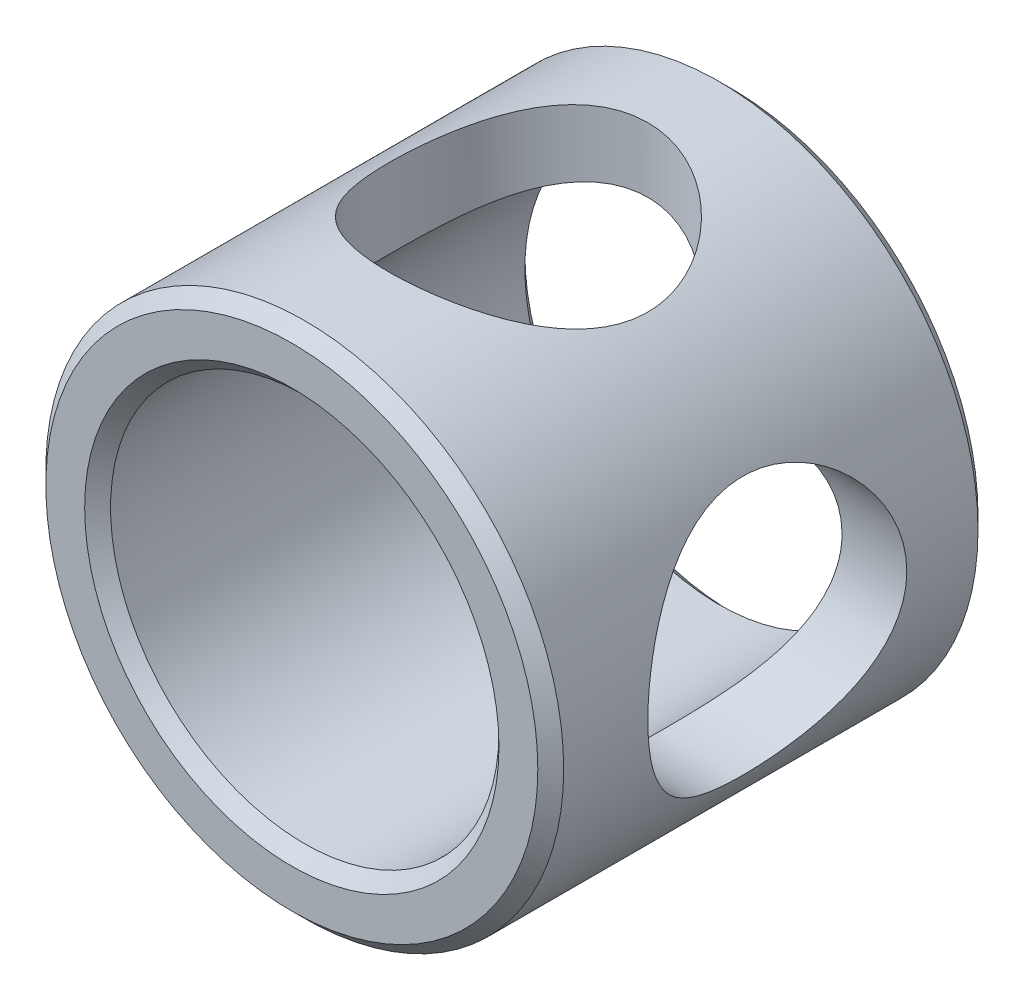
ISO-10303-21;
HEADER;
FILE_DESCRIPTION(('STEP AP214'),'2;1');
FILE_NAME('part.step','',(''),(''),'','','');
FILE_SCHEMA(('AUTOMOTIVE_DESIGN { 1 0 10303 214 1 1 1 1 }'));
ENDSEC;
DATA;
#1=APPLICATION_CONTEXT('core data for automotive mechanical design processes');
#2=APPLICATION_PROTOCOL_DEFINITION('international standard','automotive_design',2000,#1);
#3=PRODUCT_CONTEXT('',#1,'mechanical');
#4=PRODUCT('Part','Part','',(#3));
#5=PRODUCT_RELATED_PRODUCT_CATEGORY('part','',(#4));
#6=PRODUCT_DEFINITION_FORMATION('','',#4);
#7=PRODUCT_DEFINITION_CONTEXT('part definition',#1,'design');
#8=PRODUCT_DEFINITION('design','',#6,#7);
#9=PRODUCT_DEFINITION_SHAPE('','',#8);
#10=(LENGTH_UNIT() NAMED_UNIT(*) SI_UNIT(.MILLI.,.METRE.));
#11=(NAMED_UNIT(*) PLANE_ANGLE_UNIT() SI_UNIT($,.RADIAN.));
#12=(NAMED_UNIT(*) SI_UNIT($,.STERADIAN.) SOLID_ANGLE_UNIT());
#13=UNCERTAINTY_MEASURE_WITH_UNIT(LENGTH_MEASURE(1.E-05),#10,'distance_accuracy_value','');
#14=(GEOMETRIC_REPRESENTATION_CONTEXT(3) GLOBAL_UNCERTAINTY_ASSIGNED_CONTEXT((#13)) GLOBAL_UNIT_ASSIGNED_CONTEXT((#10,
#11,#12)) REPRESENTATION_CONTEXT('',''));
#15=CARTESIAN_POINT('',(0.,0.,0.));
#16=DIRECTION('',(0.,0.,1.));
#17=DIRECTION('',(1.,0.,0.));
#18=AXIS2_PLACEMENT_3D('',#15,#16,#17);
#19=CARTESIAN_POINT('',(0.,0.,6.8));
#20=DIRECTION('',(0.,0.,1.));
#21=DIRECTION('',(1.,0.,0.));
#22=AXIS2_PLACEMENT_3D('',#19,#20,#21);
#23=PLANE('',#22);
#24=CARTESIAN_POINT('',(0.,0.,6.8));
#25=DIRECTION('',(0.,0.,1.));
#26=DIRECTION('',(1.,0.,0.));
#27=AXIS2_PLACEMENT_3D('',#24,#25,#26);
#28=CIRCLE('',#27,3.8);
#29=CARTESIAN_POINT('',(3.8,0.,6.8));
#30=VERTEX_POINT('',#29);
#31=EDGE_CURVE('E10',#30,#30,#28,.T.);
#32=ORIENTED_EDGE('',*,*,#31,.T.);
#33=EDGE_LOOP('',(#32));
#34=FACE_BOUND('',#33,.T.);
#35=CARTESIAN_POINT('',(0.,0.,6.8));
#36=DIRECTION('',(0.,0.,1.));
#37=DIRECTION('',(1.,0.,0.));
#38=AXIS2_PLACEMENT_3D('',#35,#36,#37);
#39=CIRCLE('',#38,3.20000000000001);
#40=CARTESIAN_POINT('',(3.20000000000001,0.,6.8));
#41=VERTEX_POINT('',#40);
#42=EDGE_CURVE('E38',#41,#41,#39,.F.);
#43=ORIENTED_EDGE('',*,*,#42,.T.);
#44=EDGE_LOOP('',(#43));
#45=FACE_BOUND('',#44,.T.);
#46=ADVANCED_FACE('F31',(#34,#45),#23,.T.);
#47=CARTESIAN_POINT('',(0.,0.,0.));
#48=DIRECTION('',(0.,0.,1.));
#49=DIRECTION('',(1.,0.,0.));
#50=AXIS2_PLACEMENT_3D('',#47,#48,#49);
#51=PLANE('',#50);
#52=CARTESIAN_POINT('',(0.,0.,0.));
#53=DIRECTION('',(0.,0.,1.));
#54=DIRECTION('',(1.,0.,0.));
#55=AXIS2_PLACEMENT_3D('',#52,#53,#54);
#56=CIRCLE('',#55,3.2);
#57=CARTESIAN_POINT('',(3.2,0.,0.));
#58=VERTEX_POINT('',#57);
#59=EDGE_CURVE('E57',#58,#58,#56,.T.);
#60=ORIENTED_EDGE('',*,*,#59,.T.);
#61=EDGE_LOOP('',(#60));
#62=FACE_BOUND('',#61,.T.);
#63=CARTESIAN_POINT('',(0.,0.,0.));
#64=DIRECTION('',(0.,0.,1.));
#65=DIRECTION('',(1.,0.,0.));
#66=AXIS2_PLACEMENT_3D('',#63,#64,#65);
#67=CIRCLE('',#66,3.8);
#68=CARTESIAN_POINT('',(3.8,0.,0.));
#69=VERTEX_POINT('',#68);
#70=EDGE_CURVE('E60',#69,#69,#67,.F.);
#71=ORIENTED_EDGE('',*,*,#70,.T.);
#72=EDGE_LOOP('',(#71));
#73=FACE_BOUND('',#72,.T.);
#74=ADVANCED_FACE('F109',(#62,#73),#51,.F.);
#75=CARTESIAN_POINT('',(0.,0.,6.8));
#76=DIRECTION('',(0.,0.,-1.));
#77=DIRECTION('',(-1.,0.,0.));
#78=AXIS2_PLACEMENT_3D('',#75,#76,#77);
#79=CYLINDRICAL_SURFACE('',#78,4.);
#80=CARTESIAN_POINT('',(-2.00000000000001,3.46410161513775,3.3));
#81=CARTESIAN_POINT('',(-1.99999158748782,3.46411185715887,3.40421320547434));
#82=CARTESIAN_POINT('',(-1.99179963610438,3.46887633544977,3.5085621765338));
#83=CARTESIAN_POINT('',(-1.95944672580054,3.48724701669072,3.7140551772306));
#84=CARTESIAN_POINT('',(-1.93525221095663,3.50087179788182,3.81519200324776));
#85=CARTESIAN_POINT('',(-1.87219981598031,3.53498701490001,4.01090315644694));
#86=CARTESIAN_POINT('',(-1.83341988295965,3.55544089069168,4.10550925884925));
#87=CARTESIAN_POINT('',(-1.7425350724514,3.60085327291132,4.28684845047615));
#88=CARTESIAN_POINT('',(-1.6904294741014,3.62581202301253,4.37358111343677));
#89=CARTESIAN_POINT('',(-1.56933307453802,3.67993738819288,4.54461144313338));
#90=CARTESIAN_POINT('',(-1.49930407053534,3.70928127465102,4.62811826759177));
#91=CARTESIAN_POINT('',(-1.34650761698203,3.76743965382121,4.7828167805706));
#92=CARTESIAN_POINT('',(-1.26373385204843,3.79625387610258,4.85400232620397));
#93=CARTESIAN_POINT('',(-1.08097912631266,3.85242953961661,4.9867343011885));
#94=CARTESIAN_POINT('',(-0.980214377887166,3.87956212851245,5.04730753542331));
#95=CARTESIAN_POINT('',(-0.768314053336931,3.92701512184167,5.15028170678709));
#96=CARTESIAN_POINT('',(-0.657185076311999,3.94733982363631,5.1926941123508));
#97=CARTESIAN_POINT('',(-0.436089887818831,3.97760922492053,5.25500932253118));
#98=CARTESIAN_POINT('',(-0.326603580968799,3.98818960442739,5.2762990526921));
#99=CARTESIAN_POINT('',(-0.105141257404554,4.00015167691179,5.30033223736903));
#100=CARTESIAN_POINT('',(0.0068332116851934,4.00153893568935,5.30308691359629));
#101=CARTESIAN_POINT('',(0.219665048849558,3.99525963833124,5.29050665205486));
#102=CARTESIAN_POINT('',(0.320642398354125,3.98836991784381,5.27672396895636));
#103=CARTESIAN_POINT('',(0.518627543836075,3.96748490519435,5.23423831219188));
#104=CARTESIAN_POINT('',(0.615635042187687,3.95348908132772,5.20553422204788));
#105=CARTESIAN_POINT('',(0.804618783139246,3.91943166575326,5.13383486782005));
#106=CARTESIAN_POINT('',(0.896506847030384,3.89928883058403,5.09064737365578));
#107=CARTESIAN_POINT('',(1.0719536030266,3.8547529197337,4.9914731675971));
#108=CARTESIAN_POINT('',(1.15550929767727,3.83035832314967,4.93548187339533));
#109=CARTESIAN_POINT('',(1.32034732179639,3.7768878879846,4.80620929693394));
#110=CARTESIAN_POINT('',(1.40066815005871,3.74758751996351,4.73179394334797));
#111=CARTESIAN_POINT('',(1.54820874059554,3.68908681173623,4.57082055013965));
#112=CARTESIAN_POINT('',(1.61541842314845,3.65988656531258,4.48425325545188));
#113=CARTESIAN_POINT('',(1.73901066928441,3.6028831218497,4.29470361515182));
#114=CARTESIAN_POINT('',(1.79443462995609,3.57528639981416,4.19102795389158));
#115=CARTESIAN_POINT('',(1.88663822600245,3.52750900557152,3.974124657282));
#116=CARTESIAN_POINT('',(1.92343731642177,3.50732060092135,3.86090713396488));
#117=CARTESIAN_POINT('',(1.97436042205007,3.47889271634069,3.63757097743442));
#118=CARTESIAN_POINT('',(1.99005024423994,3.46983311696993,3.5279177619129));
#119=CARTESIAN_POINT('',(2.00303389322284,3.4623583872322,3.30719731696691));
#120=CARTESIAN_POINT('',(2.00034071463004,3.46393573778624,3.1961311417604));
#121=CARTESIAN_POINT('',(1.97807208668792,3.4766867308117,2.98869216284256));
#122=CARTESIAN_POINT('',(1.96037563342491,3.48679175013309,2.89204109778422));
#123=CARTESIAN_POINT('',(1.91139256926488,3.51388043102683,2.70326442745801));
#124=CARTESIAN_POINT('',(1.88010155724725,3.53086632010069,2.61114029850652));
#125=CARTESIAN_POINT('',(1.80329517720972,3.57072444159314,2.42917733819489));
#126=CARTESIAN_POINT('',(1.75718812738529,3.59383286486126,2.33964196629395));
#127=CARTESIAN_POINT('',(1.65257412803174,3.64312238994501,2.16906145692096));
#128=CARTESIAN_POINT('',(1.59406080866497,3.66930506710298,2.08802071296949));
#129=CARTESIAN_POINT('',(1.45767433439707,3.72575996912669,1.92604246495734));
#130=CARTESIAN_POINT('',(1.37829054462746,3.75613166308566,1.84640569858222));
#131=CARTESIAN_POINT('',(1.20680899079902,3.81468469955797,1.70117552399527));
#132=CARTESIAN_POINT('',(1.11470694931989,3.84286530015464,1.63558685947316));
#133=CARTESIAN_POINT('',(0.917070725108045,3.89482723381868,1.51885254816729));
#134=CARTESIAN_POINT('',(0.811246195112481,3.91847283343884,1.46813376383323));
#135=CARTESIAN_POINT('',(0.591044729317852,3.95766709918776,1.38572419203039));
#136=CARTESIAN_POINT('',(0.476675402917639,3.97322287353397,1.3540166963159));
#137=CARTESIAN_POINT('',(0.25395936453975,3.99335016363174,1.31326287251486));
#138=CARTESIAN_POINT('',(0.146022887268286,3.9987985581427,1.30240425133572));
#139=CARTESIAN_POINT('',(-0.0702519714699596,4.00084260752374,1.29831346600433));
#140=CARTESIAN_POINT('',(-0.178590198981628,3.99744136141634,1.30507513147113));
#141=CARTESIAN_POINT('',(-0.385075986136872,3.98267937668509,1.3348328243164));
#142=CARTESIAN_POINT('',(-0.483424641057431,3.97185789309443,1.35672973730905));
#143=CARTESIAN_POINT('',(-0.674891898931578,3.94384187353387,1.41465395980667));
#144=CARTESIAN_POINT('',(-0.768009749669785,3.92664642364424,1.45068329570691));
#145=CARTESIAN_POINT('',(-0.950846833596754,3.8865186139318,1.5374542549914));
#146=CARTESIAN_POINT('',(-1.04025036572291,3.86337234005403,1.58875921975186));
#147=CARTESIAN_POINT('',(-1.20954920326829,3.81376266676027,1.70391528811809));
#148=CARTESIAN_POINT('',(-1.2894401144432,3.78729774583427,1.76777215410157));
#149=CARTESIAN_POINT('',(-1.44582833859496,3.73057218840581,1.91359663555941));
#150=CARTESIAN_POINT('',(-1.521196658792,3.70019591726075,1.99673418080029));
#151=CARTESIAN_POINT('',(-1.65732528394007,3.64126158628571,2.17489222830609));
#152=CARTESIAN_POINT('',(-1.71807266521245,3.61270515130783,2.26992313136052));
#153=CARTESIAN_POINT('',(-1.82486714716812,3.55999186256751,2.47330889413024));
#154=CARTESIAN_POINT('',(-1.87038902381915,3.53600256268535,2.58198991073527));
#155=CARTESIAN_POINT('',(-1.92395929504802,3.50696218132369,2.75057811963094));
#156=CARTESIAN_POINT('',(-1.93935666147968,3.498443893294,2.80764782059068));
#157=CARTESIAN_POINT('',(-1.96508069805044,3.48406059323535,2.92323255750019));
#158=CARTESIAN_POINT('',(-1.97541091343284,3.4781937263605,2.98174655275425));
#159=CARTESIAN_POINT('',(-1.98872932961221,3.47059023668757,3.08360078924729));
#160=CARTESIAN_POINT('',(-1.99295091983788,3.46816389731815,3.12673305725007));
#161=CARTESIAN_POINT('',(-1.99858810035607,3.46491740045176,3.2132356930929));
#162=CARTESIAN_POINT('',(-2.00000350293332,3.46409735040491,3.2566060766667));
#163=CARTESIAN_POINT('',(-2.00000000000001,3.46410161513775,3.3));
#164=B_SPLINE_CURVE_WITH_KNOTS('',3,(#80,#81,#82,#83,#84,#85,#86,#87,#88,#89,#90,#91,#92,#93,
#94,#95,#96,#97,#98,#99,#100,#101,#102,#103,#104,#105,#106,#107,#108,#109,#110,#111,#112,#113,
#114,#115,#116,#117,#118,#119,#120,#121,#122,#123,#124,#125,#126,#127,#128,#129,#130,#131,#132,
#133,#134,#135,#136,#137,#138,#139,#140,#141,#142,#143,#144,#145,#146,#147,#148,#149,#150,#151,
#152,#153,#154,#155,#156,#157,#158,#159,#160,#161,#162,#163),.UNSPECIFIED.,.T.,.F.,(4,2,2,2,2,2,
2,2,2,2,2,2,2,2,2,2,2,2,2,2,2,2,2,2,2,2,2,2,2,2,2,2,2,2,2,2,2,2,2,2,2,4),(0.,0.312464245189431,
0.62558578564961,0.937057191861537,1.24854545093096,1.58572462503713,1.92307142172809,
2.28315784481594,2.64301653931849,2.97726969939937,3.31132047376147,3.61632194973143,
3.92134625038977,4.2305906946636,4.5399459870461,4.87854382917848,5.21740096495904,
5.57777683462963,5.93777548427476,6.2692458171249,6.60048186380813,6.89548366852118,
7.19058104876193,7.49934592816242,7.80826972444161,8.15613487165293,8.50411729960471,
8.86128362829998,9.2181355962161,9.5422454078304,9.8662417359201,10.1688884974705,
10.4715786702809,10.7872150144301,11.1029966020551,11.450204837042,11.7977188569438,
12.1562149808128,12.3351395323571,12.5139387197526,12.6440387634036,12.7741475095882),.UNSPECIFIED.);
#165=CARTESIAN_POINT('',(-2.00000000000001,3.46410161513775,3.3));
#166=VERTEX_POINT('',#165);
#167=EDGE_CURVE('E90',#166,#166,#164,.T.);
#168=ORIENTED_EDGE('',*,*,#167,.F.);
#169=EDGE_LOOP('',(#168));
#170=FACE_BOUND('',#169,.T.);
#171=CARTESIAN_POINT('',(4.,0.,1.3));
#172=CARTESIAN_POINT('',(3.99999426810082,0.105143925902467,1.30000660463438));
#173=CARTESIAN_POINT('',(3.99580982039513,0.210413199395125,1.30834014624211));
#174=CARTESIAN_POINT('',(3.97948312074314,0.417840470537792,1.34130576068308));
#175=CARTESIAN_POINT('',(3.96732575657839,0.519992173427259,1.36596878599563));
#176=CARTESIAN_POINT('',(3.93632558806751,0.717867089760898,1.43038761723326));
#177=CARTESIAN_POINT('',(3.91750878355075,0.813613605878293,1.47008476849594));
#178=CARTESIAN_POINT('',(3.87491553031523,0.996945233613197,1.56314124272997));
#179=CARTESIAN_POINT('',(3.85113947267051,1.08453098798012,1.61649948849773));
#180=CARTESIAN_POINT('',(3.79912516516124,1.25501563552382,1.73903449897057));
#181=CARTESIAN_POINT('',(3.77070398255074,1.33731042224422,1.80897295847928));
#182=CARTESIAN_POINT('',(3.71319940493486,1.48955888973396,1.96104295849407));
#183=CARTESIAN_POINT('',(3.68411552418069,1.55950316621353,2.04318370354488));
#184=CARTESIAN_POINT('',(3.62597902394695,1.69050400090056,2.22496669904676));
#185=CARTESIAN_POINT('',(3.59710373940264,1.75045067110327,2.32547219669183));
#186=CARTESIAN_POINT('',(3.54571957544641,1.85233645378139,2.53673467197243));
#187=CARTESIAN_POINT('',(3.52320615213979,1.89428842993267,2.6474842574455));
#188=CARTESIAN_POINT('',(3.48915734075617,1.95626488437718,2.86933021084384));
#189=CARTESIAN_POINT('',(3.47704543167427,1.97745171416088,2.98000890413479));
#190=CARTESIAN_POINT('',(3.46363779897055,2.00085398661769,3.20395767555895));
#191=CARTESIAN_POINT('',(3.46233138686576,2.00308817674615,3.31722508174231));
#192=CARTESIAN_POINT('',(3.47021860514497,1.98937457434459,3.52857204863074));
#193=CARTESIAN_POINT('',(3.47817527324027,1.97556911907364,3.6268480624461));
#194=CARTESIAN_POINT('',(3.50152457467701,1.93387969811386,3.81944381874608));
#195=CARTESIAN_POINT('',(3.51691957663553,1.9059912477953,3.91376229061063));
#196=CARTESIAN_POINT('',(3.55374952825482,1.83641956077201,4.09845826513132));
#197=CARTESIAN_POINT('',(3.57531681327997,1.79443013423199,4.18869279757158));
#198=CARTESIAN_POINT('',(3.62206808562807,1.698083375336,4.36126858518002));
#199=CARTESIAN_POINT('',(3.64725369560381,1.64372048762493,4.44360627120018));
#200=CARTESIAN_POINT('',(3.70226315806572,1.51613210982558,4.60904250548645));
#201=CARTESIAN_POINT('',(3.73227020473492,1.44138891673856,4.69091374715231));
#202=CARTESIAN_POINT('',(3.79095246600814,1.27911115748275,4.8414708371818));
#203=CARTESIAN_POINT('',(3.81962703917602,1.19157051314857,4.91015038406777));
#204=CARTESIAN_POINT('',(3.87403974565928,1.0010330116637,5.03537132205945));
#205=CARTESIAN_POINT('',(3.89957968324014,0.897507183198818,5.09120094489148));
#206=CARTESIAN_POINT('',(3.94315762242485,0.680932430977593,5.18419405808602));
#207=CARTESIAN_POINT('',(3.96120157887106,0.567891152530552,5.22137237003033));
#208=CARTESIAN_POINT('',(3.98648667482871,0.345532983321405,5.27295080743335));
#209=CARTESIAN_POINT('',(3.9944987660262,0.236683061096653,5.28898247149356));
#210=CARTESIAN_POINT('',(4.00146026918207,0.0175591998987038,5.30292946226898));
#211=CARTESIAN_POINT('',(4.00041397442637,-0.0927140397398167,5.30085337127894));
#212=CARTESIAN_POINT('',(3.9898238450687,-0.302465943971973,5.27958662316251));
#213=CARTESIAN_POINT('',(3.98094491376337,-0.402118816099859,5.26173493454001));
#214=CARTESIAN_POINT('',(3.95644342629681,-0.596813784603881,5.21152385620976));
#215=CARTESIAN_POINT('',(3.94082012668824,-0.691855371382173,5.17916286709301));
#216=CARTESIAN_POINT('',(3.90368502827176,-0.877777216899145,5.10000306713393));
#217=CARTESIAN_POINT('',(3.88201763539262,-0.968460794011606,5.05281789976743));
#218=CARTESIAN_POINT('',(3.83487948634835,-1.14092272339854,4.94578492870687));
#219=CARTESIAN_POINT('',(3.80940711133877,-1.22269725955318,4.88593173080921));
#220=CARTESIAN_POINT('',(3.75416442672396,-1.38353537857843,4.74847914933857));
#221=CARTESIAN_POINT('',(3.72421769686998,-1.46154415563805,4.66971426310971));
#222=CARTESIAN_POINT('',(3.6652478321764,-1.60371264223771,4.50014969744455));
#223=CARTESIAN_POINT('',(3.63622534800094,-1.66786277142375,4.40934176230416));
#224=CARTESIAN_POINT('',(3.58102384412979,-1.78341582895804,4.21271269165405));
#225=CARTESIAN_POINT('',(3.55505059178121,-1.8340509916005,4.10637746781104));
#226=CARTESIAN_POINT('',(3.51148144588269,-1.91616565186941,3.88497986485007));
#227=CARTESIAN_POINT('',(3.493874764435,-1.94766983173403,3.76992894706622));
#228=CARTESIAN_POINT('',(3.47123002051604,-1.98772337493374,3.54617955423059));
#229=CARTESIAN_POINT('',(3.4651476693013,-1.9981859928109,3.43793149312952));
#230=CARTESIAN_POINT('',(3.46330709283207,-2.0013783087524,3.22110586567095));
#231=CARTESIAN_POINT('',(3.4675443925278,-1.99411569324648,3.11252846252428));
#232=CARTESIAN_POINT('',(3.48475724102153,-1.96385225118662,2.90903299693313));
#233=CARTESIAN_POINT('',(3.49686188965317,-1.94241662868607,2.81379905971052));
#234=CARTESIAN_POINT('',(3.52742032375305,-1.88635071644882,2.62838376115127));
#235=CARTESIAN_POINT('',(3.54587615139337,-1.85171618231984,2.53820403581594));
#236=CARTESIAN_POINT('',(3.58857060729071,-1.76763149060113,2.35875029802693));
#237=CARTESIAN_POINT('',(3.61311444791841,-1.7173422756314,2.26994419634194));
#238=CARTESIAN_POINT('',(3.66470663269721,-1.60430194327478,2.10145092763748));
#239=CARTESIAN_POINT('',(3.69175627591221,-1.54154434248312,2.02176853895778));
#240=CARTESIAN_POINT('',(3.74924646316184,-1.39640665332275,1.86371603529065));
#241=CARTESIAN_POINT('',(3.77969966613256,-1.31256884599452,1.78668179529942));
#242=CARTESIAN_POINT('',(3.83755504519861,-1.13230961246639,1.64747403312946));
#243=CARTESIAN_POINT('',(3.8649555725239,-1.03588144661039,1.58530852106019));
#244=CARTESIAN_POINT('',(3.91396019133075,-0.831863193565891,1.47752727457586));
#245=CARTESIAN_POINT('',(3.93552192987866,-0.724199007553461,1.43203166152706));
#246=CARTESIAN_POINT('',(3.97002682597974,-0.501484202276173,1.36038366448518));
#247=CARTESIAN_POINT('',(3.98299446726136,-0.3864555991782,1.33417630638857));
#248=CARTESIAN_POINT('',(3.99390923826956,-0.22520389298179,1.31220517782852));
#249=CARTESIAN_POINT('',(3.99618730680502,-0.18032375888313,1.30763471826732));
#250=CARTESIAN_POINT('',(3.99923393953631,-0.0903034636101831,1.30153066897183));
#251=CARTESIAN_POINT('',(4.00000246206762,-0.0451632952932569,1.29999716305958));
#252=CARTESIAN_POINT('',(4.,0.,1.3));
#253=B_SPLINE_CURVE_WITH_KNOTS('',3,(#171,#172,#173,#174,#175,#176,#177,#178,#179,#180,#181,
#182,#183,#184,#185,#186,#187,#188,#189,#190,#191,#192,#193,#194,#195,#196,#197,#198,#199,#200,
#201,#202,#203,#204,#205,#206,#207,#208,#209,#210,#211,#212,#213,#214,#215,#216,#217,#218,#219,
#220,#221,#222,#223,#224,#225,#226,#227,#228,#229,#230,#231,#232,#233,#234,#235,#236,#237,#238,
#239,#240,#241,#242,#243,#244,#245,#246,#247,#248,#249,#250,#251,#252),.UNSPECIFIED.,.T.,.F.,(4,
2,2,2,2,2,2,2,2,2,2,2,2,2,2,2,2,2,2,2,2,2,2,2,2,2,2,2,2,2,2,2,2,2,2,2,2,2,2,2,4),(0.,
0.315248514840585,0.631096299418395,0.945724310984597,1.26032752116314,1.59396351743618,
1.92785247530807,2.28763452861505,2.64715895796562,2.98516024280459,3.32282714658041,
3.62011424818641,3.91749607851357,4.22180480336975,4.52625042520443,4.86929882667757,
5.21251069197372,5.57166044428881,5.93052433824559,6.25966580942691,6.58865129022952,
6.89213813012244,7.19565843261863,7.50785712055797,7.82018901496678,8.16319221288837,
8.50643177230863,8.86629364323451,9.22569023890901,9.55058615006093,9.87534119729357,
10.1691586049771,10.463070575767,10.7767291356057,11.0905512228726,11.4425048551434,
11.7946476676249,12.1492802732705,12.502898172423,12.6383056026783,12.7737167702213),.UNSPECIFIED.);
#254=CARTESIAN_POINT('',(4.,0.,1.3));
#255=VERTEX_POINT('',#254);
#256=EDGE_CURVE('E70',#255,#255,#253,.T.);
#257=ORIENTED_EDGE('',*,*,#256,.F.);
#258=EDGE_LOOP('',(#257));
#259=FACE_BOUND('',#258,.T.);
#260=CARTESIAN_POINT('',(0.,0.,0.199999999999999));
#261=DIRECTION('',(0.,0.,1.));
#262=DIRECTION('',(1.,0.,0.));
#263=AXIS2_PLACEMENT_3D('',#260,#261,#262);
#264=CIRCLE('',#263,4.);
#265=CARTESIAN_POINT('',(4.,0.,0.199999999999999));
#266=VERTEX_POINT('',#265);
#267=EDGE_CURVE('E42',#266,#266,#264,.T.);
#268=ORIENTED_EDGE('',*,*,#267,.T.);
#269=EDGE_LOOP('',(#268));
#270=FACE_BOUND('',#269,.T.);
#271=CARTESIAN_POINT('',(0.,0.,6.6));
#272=DIRECTION('',(0.,0.,1.));
#273=DIRECTION('',(1.,0.,0.));
#274=AXIS2_PLACEMENT_3D('',#271,#272,#273);
#275=CIRCLE('',#274,4.);
#276=CARTESIAN_POINT('',(4.,0.,6.6));
#277=VERTEX_POINT('',#276);
#278=EDGE_CURVE('E46',#277,#277,#275,.F.);
#279=ORIENTED_EDGE('',*,*,#278,.T.);
#280=EDGE_LOOP('',(#279));
#281=FACE_BOUND('',#280,.T.);
#282=ADVANCED_FACE('F105',(#170,#259,#270,#281),#79,.T.);
#283=CARTESIAN_POINT('',(0.,0.,6.8));
#284=DIRECTION('',(0.,0.,-1.));
#285=DIRECTION('',(-1.,0.,0.));
#286=AXIS2_PLACEMENT_3D('',#283,#284,#285);
#287=CYLINDRICAL_SURFACE('',#286,3.);
#288=CARTESIAN_POINT('',(-2.00000000000001,2.23606797749978,3.3));
#289=CARTESIAN_POINT('',(-1.99999453997732,2.23607753462816,3.39762831086862));
#290=CARTESIAN_POINT('',(-1.99278992503665,2.24258071047441,3.4952907537088));
#291=CARTESIAN_POINT('',(-1.96458268317732,2.26731972501616,3.68711991165081));
#292=CARTESIAN_POINT('',(-1.94355530587863,2.2855766081271,3.78128003552957));
#293=CARTESIAN_POINT('',(-1.88935861676633,2.33056585825569,3.96273544187769));
#294=CARTESIAN_POINT('',(-1.85630718014215,2.35721561794601,4.05008769673766));
#295=CARTESIAN_POINT('',(-1.77934008393539,2.41584094681825,4.21786583234667));
#296=CARTESIAN_POINT('',(-1.73542216812164,2.4478176215883,4.29829026997647));
#297=CARTESIAN_POINT('',(-1.63002410007715,2.51946072932025,4.46364688761691));
#298=CARTESIAN_POINT('',(-1.56687435451733,2.55954936090363,4.5473321177172));
#299=CARTESIAN_POINT('',(-1.42819219740681,2.63944827308082,4.70400270887428));
#300=CARTESIAN_POINT('',(-1.35264773177081,2.67925824297984,4.77697752165853));
#301=CARTESIAN_POINT('',(-1.17815690494296,2.76088818523747,4.92064365878167));
#302=CARTESIAN_POINT('',(-1.0774064396582,2.80216785846922,4.98948251177567));
#303=CARTESIAN_POINT('',(-0.86247096421224,2.87558484482764,5.10864209549007));
#304=CARTESIAN_POINT('',(-0.748301152321712,2.90773236231037,5.15898351403119));
#305=CARTESIAN_POINT('',(-0.523249073480012,2.95599907464725,5.23355640101745));
#306=CARTESIAN_POINT('',(-0.413434725181425,2.97351175615867,5.26008334449556));
#307=CARTESIAN_POINT('',(-0.189695448729871,2.99609745461921,5.29418448928365));
#308=CARTESIAN_POINT('',(-0.0757758812858336,3.00118613762359,5.30178255922544));
#309=CARTESIAN_POINT('',(0.134147050232321,2.99855361722953,5.29782755005095));
#310=CARTESIAN_POINT('',(0.230240638008744,2.99266264910127,5.28901094868294));
#311=CARTESIAN_POINT('',(0.419238633271007,2.9720818279002,5.25790894864109));
#312=CARTESIAN_POINT('',(0.512142807649715,2.95739133313102,5.23562256769646));
#313=CARTESIAN_POINT('',(0.69207793767116,2.92052091703737,5.17880431520542));
#314=CARTESIAN_POINT('',(0.779130623845953,2.89837077982679,5.14432111480144));
#315=CARTESIAN_POINT('',(0.946209150653548,2.84821104476288,5.06444635704718));
#316=CARTESIAN_POINT('',(1.02623370496939,2.82020037745162,5.01905280849849));
#317=CARTESIAN_POINT('',(1.18828429196343,2.75618058450703,4.91202126254011));
#318=CARTESIAN_POINT('',(1.26919148099707,2.71960408792025,4.84903247664721));
#319=CARTESIAN_POINT('',(1.41998807498304,2.64400601826998,4.71210132051968));
#320=CARTESIAN_POINT('',(1.48986013519456,2.60498072815232,4.63814205406619));
#321=CARTESIAN_POINT('',(1.62772235326164,2.52150044944152,4.46803678978671));
#322=CARTESIAN_POINT('',(1.69373593126354,2.47714320008932,4.37022892028551));
#323=CARTESIAN_POINT('',(1.80834874945482,2.39475610831096,4.16249016077928));
#324=CARTESIAN_POINT('',(1.85697718654897,2.3567157153489,4.0525800055861));
#325=CARTESIAN_POINT('',(1.92332724567775,2.3026287030689,3.8552809379269));
#326=CARTESIAN_POINT('',(1.94590791747532,2.28340364577668,3.77040662994312));
#327=CARTESIAN_POINT('',(1.97979555580013,2.25409039789613,3.59696051018316));
#328=CARTESIAN_POINT('',(1.99112206964394,2.24398636782355,3.50839538882738));
#329=CARTESIAN_POINT('',(2.00179400148876,2.23447556987373,3.3295570135585));
#330=CARTESIAN_POINT('',(2.00108729753097,2.2351153386647,3.23927802147988));
#331=CARTESIAN_POINT('',(1.98761629716364,2.24709880368953,3.06031616604495));
#332=CARTESIAN_POINT('',(1.9748422269038,2.25845117648851,2.97163465589261));
#333=CARTESIAN_POINT('',(1.93899811187045,2.28927977500747,2.80261058245016));
#334=CARTESIAN_POINT('',(1.91646174529972,2.3083318706975,2.72207229099742));
#335=CARTESIAN_POINT('',(1.86223041628512,2.35229958533651,2.5658737639497));
#336=CARTESIAN_POINT('',(1.8305323780535,2.37721717294631,2.49021517703699));
#337=CARTESIAN_POINT('',(1.75163346599562,2.43611483596195,2.32979799615248));
#338=CARTESIAN_POINT('',(1.70260028818245,2.47091081434317,2.2462431884573));
#339=CARTESIAN_POINT('',(1.59352731501437,2.54262514806634,2.08758319738271));
#340=CARTESIAN_POINT('',(1.53347411883826,2.57954604947544,2.01248848325755));
#341=CARTESIAN_POINT('',(1.38876657712434,2.66075678321008,1.85603765253246));
#342=CARTESIAN_POINT('',(1.30160386514206,2.70489452138574,1.77689715175168));
#343=CARTESIAN_POINT('',(1.11309948866218,2.78775581841638,1.63418331705971));
#344=CARTESIAN_POINT('',(1.01177047745699,2.82648414789458,1.57059622874327));
#345=CARTESIAN_POINT('',(0.817487474821785,2.88790821242222,1.47210826108241));
#346=CARTESIAN_POINT('',(0.726662364886309,2.91225458111009,1.43404349555963));
#347=CARTESIAN_POINT('',(0.538757079020503,2.95278707867041,1.37139280567956));
#348=CARTESIAN_POINT('',(0.441682263858757,2.96898009871993,1.34679549714023));
#349=CARTESIAN_POINT('',(0.24336939230343,2.99178364026746,1.31230303616125));
#350=CARTESIAN_POINT('',(0.142114836924306,2.99835150856533,1.30247332049332));
#351=CARTESIAN_POINT('',(-0.060855546580744,3.00109821029056,1.2983521485829));
#352=CARTESIAN_POINT('',(-0.16257133095346,2.99727800938901,1.30405924804383));
#353=CARTESIAN_POINT('',(-0.355757532528119,2.98029555977323,1.3296594890047));
#354=CARTESIAN_POINT('',(-0.447435143070544,2.96783277209856,1.34849098486181));
#355=CARTESIAN_POINT('',(-0.626018422997075,2.93536106206933,1.3982380094309));
#356=CARTESIAN_POINT('',(-0.712923348686903,2.91535096747102,1.42915541534726));
#357=CARTESIAN_POINT('',(-0.885147296608363,2.86791765486194,1.50393870488403));
#358=CARTESIAN_POINT('',(-0.970083589200276,2.84013248946338,1.54845030749508));
#359=CARTESIAN_POINT('',(-1.13155266268319,2.77975408235471,1.64815064462599));
#360=CARTESIAN_POINT('',(-1.20808037205003,2.74715796645263,1.703345767952));
#361=CARTESIAN_POINT('',(-1.36329422201403,2.67392931472394,1.83262890233631));
#362=CARTESIAN_POINT('',(-1.44042679526092,2.63283913877369,1.90832302367404));
#363=CARTESIAN_POINT('',(-1.58160022281597,2.55053357649486,2.07111354154584));
#364=CARTESIAN_POINT('',(-1.64563128323924,2.50931811970154,2.1582183888341));
#365=CARTESIAN_POINT('',(-1.75513253518412,2.43384213590297,2.3358675907553));
#366=CARTESIAN_POINT('',(-1.80164646897211,2.39929086741903,2.42564180995035));
#367=CARTESIAN_POINT('',(-1.88115802340273,2.33747501591022,2.61328444899316));
#368=CARTESIAN_POINT('',(-1.91418190281334,2.31019631295304,2.71113669386216));
#369=CARTESIAN_POINT('',(-1.95936262470909,2.27191051929539,2.89077146842455));
#370=CARTESIAN_POINT('',(-1.97452228373249,2.25863695410151,2.9713082367903));
#371=CARTESIAN_POINT('',(-1.99483915818927,2.24071519216008,3.13455640050454));
#372=CARTESIAN_POINT('',(-2.00000462703716,2.23605987841475,3.21726594426058));
#373=CARTESIAN_POINT('',(-2.00000000000001,2.23606797749978,3.3));
#374=B_SPLINE_CURVE_WITH_KNOTS('',3,(#288,#289,#290,#291,#292,#293,#294,#295,#296,#297,#298,
#299,#300,#301,#302,#303,#304,#305,#306,#307,#308,#309,#310,#311,#312,#313,#314,#315,#316,#317,
#318,#319,#320,#321,#322,#323,#324,#325,#326,#327,#328,#329,#330,#331,#332,#333,#334,#335,#336,
#337,#338,#339,#340,#341,#342,#343,#344,#345,#346,#347,#348,#349,#350,#351,#352,#353,#354,#355,
#356,#357,#358,#359,#360,#361,#362,#363,#364,#365,#366,#367,#368,#369,#370,#371,#372,#373),
.UNSPECIFIED.,.T.,.F.,(4,2,2,2,2,2,2,2,2,2,2,2,2,2,2,2,2,2,2,2,2,2,2,2,2,2,2,2,2,2,2,2,2,2,2,2,
2,2,2,2,2,2,4),(0.,0.292506930722153,0.585539042259288,0.875772651216275,1.16606657266549,
1.50154677068638,1.83735518436276,2.2216703100629,2.6055542938858,2.9463748206358,
3.28676536688298,3.57539534955742,3.86404638283746,4.15155831973191,4.43912276903,
4.76447525946635,5.09033414796638,5.46678703504944,5.84260469743948,6.11126090401324,
6.37944966235486,6.64880037638036,6.91836943570598,7.17476451706936,7.43124577644957,
7.73899230052352,8.04711556801509,8.42254684520963,8.7976449057258,9.10070580611698,
9.40351012888472,9.70765229266164,10.0117661844615,10.2937678224973,10.5758132789284,
10.874178629859,11.1727229593109,11.5182220628451,11.863978504186,12.1833412579672,
12.5020793664923,12.7501661630426,12.9980479966543),.UNSPECIFIED.);
#375=CARTESIAN_POINT('',(-2.00000000000001,2.23606797749978,3.3));
#376=VERTEX_POINT('',#375);
#377=EDGE_CURVE('E93',#376,#376,#374,.T.);
#378=ORIENTED_EDGE('',*,*,#377,.T.);
#379=EDGE_LOOP('',(#378));
#380=FACE_BOUND('',#379,.T.);
#381=CARTESIAN_POINT('',(3.,0.,1.3));
#382=CARTESIAN_POINT('',(3.0000004164484,0.100484716668078,1.29999945036753));
#383=CARTESIAN_POINT('',(2.99490802753388,0.200969087132901,1.3076139699555));
#384=CARTESIAN_POINT('',(2.97504652423809,0.398733058031681,1.33759686410566));
#385=CARTESIAN_POINT('',(2.96027281581235,0.496011113955007,1.3599722431233));
#386=CARTESIAN_POINT('',(2.92250482404708,0.684212307854249,1.41810771732484));
#387=CARTESIAN_POINT('',(2.89954905493315,0.775162872657554,1.45380514000794));
#388=CARTESIAN_POINT('',(2.8472613787744,0.94941529099726,1.5370633632715));
#389=CARTESIAN_POINT('',(2.8179285460551,1.03271603160967,1.58462588630056));
#390=CARTESIAN_POINT('',(2.75227329369838,1.19728470077011,1.69465693736743));
#391=CARTESIAN_POINT('',(2.71556897579319,1.27778030546067,1.75804786074289));
#392=CARTESIAN_POINT('',(2.63982313083466,1.42772804469274,1.89573004865845));
#393=CARTESIAN_POINT('',(2.60077830356832,1.49716405543888,1.97003692983774));
#394=CARTESIAN_POINT('',(2.51728264678794,1.63422297745496,2.14105236761268));
#395=CARTESIAN_POINT('',(2.47295067937795,1.6998318636275,2.23944565320345));
#396=CARTESIAN_POINT('',(2.3908414735282,1.81350357014175,2.44836337764653));
#397=CARTESIAN_POINT('',(2.35305295954668,1.86159673426503,2.55886640156274));
#398=CARTESIAN_POINT('',(2.2997626664146,1.92674035011438,2.75671129342163));
#399=CARTESIAN_POINT('',(2.28097627892403,1.94874447236008,2.84152845287391));
#400=CARTESIAN_POINT('',(2.25257969659604,1.98150617785228,3.01474450474165));
#401=CARTESIAN_POINT('',(2.24295368744147,1.99228314651963,3.10313694872606));
#402=CARTESIAN_POINT('',(2.23436605608045,2.00191364141227,3.28147477885647));
#403=CARTESIAN_POINT('',(2.23544802558502,2.00071842917524,3.3714250234524));
#404=CARTESIAN_POINT('',(2.24819775483425,1.98637581333356,3.54963497349976));
#405=CARTESIAN_POINT('',(2.25987448286881,1.97321828380393,3.63789318202813));
#406=CARTESIAN_POINT('',(2.29127185989959,1.93664994217326,3.80646705124188));
#407=CARTESIAN_POINT('',(2.31061488324375,1.91371711479477,3.88696133593877));
#408=CARTESIAN_POINT('',(2.35509622933623,1.85870118583424,4.04302369097578));
#409=CARTESIAN_POINT('',(2.3802364585489,1.8266150732855,4.11859013023865));
#410=CARTESIAN_POINT('',(2.43964196377947,1.74673818732648,4.27902539535644));
#411=CARTESIAN_POINT('',(2.47472317740626,1.69708052300445,4.3626599004831));
#412=CARTESIAN_POINT('',(2.54691537733438,1.58668960438221,4.52138339528575));
#413=CARTESIAN_POINT('',(2.58402882709328,1.52594268999614,4.59646165776207));
#414=CARTESIAN_POINT('',(2.66543343763724,1.37981165322309,4.75254254560342));
#415=CARTESIAN_POINT('',(2.7095474472056,1.29193938283656,4.83133404868276));
#416=CARTESIAN_POINT('',(2.79218100665212,1.10200799908008,4.97319649453848));
#417=CARTESIAN_POINT('',(2.83070577648042,0.999962299343696,5.03628214540898));
#418=CARTESIAN_POINT('',(2.89145404090364,0.804857827096529,5.13347771862287));
#419=CARTESIAN_POINT('',(2.9153926116554,0.713957643371909,5.17084336333894));
#420=CARTESIAN_POINT('',(2.95507719030499,0.52603604393548,5.23210492562537));
#421=CARTESIAN_POINT('',(2.97083012127543,0.429019879001649,5.25601222713222));
#422=CARTESIAN_POINT('',(2.99275882156808,0.23098545317228,5.289161165238));
#423=CARTESIAN_POINT('',(2.99889322461187,0.129951811934157,5.29833946093826));
#424=CARTESIAN_POINT('',(3.00083114965147,-0.0724415193893468,5.30124708856221));
#425=CARTESIAN_POINT('',(2.99663539385634,-0.173801186186625,5.29497750048877));
#426=CARTESIAN_POINT('',(2.97899589424273,-0.366455717204239,5.26837594443805));
#427=CARTESIAN_POINT('',(2.96622246390226,-0.457957444679193,5.24906270224478));
#428=CARTESIAN_POINT('',(2.93318449284837,-0.636116392427401,5.19840431398714));
#429=CARTESIAN_POINT('',(2.91291875746989,-0.722772837571134,5.16705724907179));
#430=CARTESIAN_POINT('',(2.86496352529158,-0.894664750465997,5.09134770295508));
#431=CARTESIAN_POINT('',(2.83689870135785,-0.979496184631419,5.04631184591814));
#432=CARTESIAN_POINT('',(2.77601855611511,-1.14068302395729,4.94556671005373));
#433=CARTESIAN_POINT('',(2.74320030403941,-1.21703314820091,4.88985083946783));
#434=CARTESIAN_POINT('',(2.6695454665343,-1.37185445482324,4.75939213184249));
#435=CARTESIAN_POINT('',(2.62826156800165,-1.44875187569565,4.68303373992491));
#436=CARTESIAN_POINT('',(2.54571173085958,-1.58933968069449,4.51888857004288));
#437=CARTESIAN_POINT('',(2.50444582417845,-1.6530209365723,4.43109396089249));
#438=CARTESIAN_POINT('',(2.4293967897058,-1.76124776549313,4.25285758723188));
#439=CARTESIAN_POINT('',(2.39527597025701,-1.80695636125283,4.16326796653779));
#440=CARTESIAN_POINT('',(2.33438974266155,-1.88496213740264,3.97612734755637));
#441=CARTESIAN_POINT('',(2.30761112529822,-1.91728345682189,3.87859106169538));
#442=CARTESIAN_POINT('',(2.26933208182633,-1.9623584346534,3.69543551280459));
#443=CARTESIAN_POINT('',(2.25594998021257,-1.97758597566225,3.61082819012399));
#444=CARTESIAN_POINT('',(2.23879466438398,-1.99699205923373,3.43942671868161));
#445=CARTESIAN_POINT('',(2.23501101347816,-2.00118260285317,3.3526350488605));
#446=CARTESIAN_POINT('',(2.23764201149981,-1.99823921981266,3.1793569432763));
#447=CARTESIAN_POINT('',(2.24406269907463,-1.99109858767783,3.09287071862624));
#448=CARTESIAN_POINT('',(2.26610452403491,-1.96596997224746,2.92265647146789));
#449=CARTESIAN_POINT('',(2.28173793527615,-1.94796751728258,2.83893228617568));
#450=CARTESIAN_POINT('',(2.32526843904801,-1.89593035657494,2.65428881351877));
#451=CARTESIAN_POINT('',(2.35532333574983,-1.85890187130765,2.55473228705667));
#452=CARTESIAN_POINT('',(2.42222161121309,-1.77084526236221,2.36451316561579));
#453=CARTESIAN_POINT('',(2.459074496867,-1.71979748341259,2.27386330200831));
#454=CARTESIAN_POINT('',(2.53617186577119,-1.60398280555153,2.10071811286377));
#455=CARTESIAN_POINT('',(2.5764658739228,-1.53898309894021,2.01840125457695));
#456=CARTESIAN_POINT('',(2.65628301537844,-1.39671768031094,1.86467752174207));
#457=CARTESIAN_POINT('',(2.69580590832396,-1.31944821025748,1.79327400297079));
#458=CARTESIAN_POINT('',(2.77631551964082,-1.14145732976974,1.65328789569092));
#459=CARTESIAN_POINT('',(2.81669805449991,-1.03896166955575,1.58658135982168));
#460=CARTESIAN_POINT('',(2.88777665874161,-0.820868555771217,1.4720867233347));
#461=CARTESIAN_POINT('',(2.91848793445255,-0.705292062449157,1.42426889317605));
#462=CARTESIAN_POINT('',(2.96101644836895,-0.491435069835746,1.35884542183622));
#463=CARTESIAN_POINT('',(2.97551480368935,-0.395012325257921,1.33688896090138));
#464=CARTESIAN_POINT('',(2.99500280141853,-0.199058012023946,1.3074719674619));
#465=CARTESIAN_POINT('',(2.99999958751315,-0.0995288361880077,1.30000054440399));
#466=CARTESIAN_POINT('',(3.,0.,1.3));
#467=B_SPLINE_CURVE_WITH_KNOTS('',3,(#381,#382,#383,#384,#385,#386,#387,#388,#389,#390,#391,
#392,#393,#394,#395,#396,#397,#398,#399,#400,#401,#402,#403,#404,#405,#406,#407,#408,#409,#410,
#411,#412,#413,#414,#415,#416,#417,#418,#419,#420,#421,#422,#423,#424,#425,#426,#427,#428,#429,
#430,#431,#432,#433,#434,#435,#436,#437,#438,#439,#440,#441,#442,#443,#444,#445,#446,#447,#448,
#449,#450,#451,#452,#453,#454,#455,#456,#457,#458,#459,#460,#461,#462,#463,#464,#465,#466),
.UNSPECIFIED.,.T.,.F.,(4,2,2,2,2,2,2,2,2,2,2,2,2,2,2,2,2,2,2,2,2,2,2,2,2,2,2,2,2,2,2,2,2,2,2,2,
2,2,2,2,2,2,4),(0.,0.3010532265054,0.602249414348688,0.902046153190232,1.20188643867386,
1.52717029000557,1.85292411604319,2.23006683295982,2.60655305445439,2.87433693676029,
3.14165767845809,3.41006711735378,3.67870397263352,3.93548862198022,4.19235783805078,
4.50147574660873,4.81097703780057,5.18718954496752,5.56304840301362,5.86524087696758,
6.16717735142813,6.47040883294251,6.77361911533415,7.05553084792472,7.3374875513827,
7.63652346829516,7.93574454945204,8.28228176141291,8.62905753175758,8.94649935304476,
9.26336626640723,9.52324048016135,9.78283200333091,10.0425772028455,10.302669238524,
10.6320660870419,10.9619271337795,11.2977924520448,11.6337608397015,12.0179535155883,
12.4015390656083,12.6999529136674,12.9981423125957),.UNSPECIFIED.);
#468=CARTESIAN_POINT('',(3.,0.,1.3));
#469=VERTEX_POINT('',#468);
#470=EDGE_CURVE('E63',#469,#469,#467,.T.);
#471=ORIENTED_EDGE('',*,*,#470,.T.);
#472=EDGE_LOOP('',(#471));
#473=FACE_BOUND('',#472,.T.);
#474=CARTESIAN_POINT('',(0.,0.,0.199999999999999));
#475=DIRECTION('',(0.,0.,1.));
#476=DIRECTION('',(1.,0.,0.));
#477=AXIS2_PLACEMENT_3D('',#474,#475,#476);
#478=CIRCLE('',#477,3.);
#479=CARTESIAN_POINT('',(3.,0.,0.199999999999999));
#480=VERTEX_POINT('',#479);
#481=EDGE_CURVE('E51',#480,#480,#478,.F.);
#482=ORIENTED_EDGE('',*,*,#481,.T.);
#483=EDGE_LOOP('',(#482));
#484=FACE_BOUND('',#483,.T.);
#485=CARTESIAN_POINT('',(0.,0.,6.6));
#486=DIRECTION('',(0.,0.,1.));
#487=DIRECTION('',(1.,0.,0.));
#488=AXIS2_PLACEMENT_3D('',#485,#486,#487);
#489=CIRCLE('',#488,3.);
#490=CARTESIAN_POINT('',(3.,0.,6.6));
#491=VERTEX_POINT('',#490);
#492=EDGE_CURVE('E54',#491,#491,#489,.T.);
#493=ORIENTED_EDGE('',*,*,#492,.T.);
#494=EDGE_LOOP('',(#493));
#495=FACE_BOUND('',#494,.T.);
#496=ADVANCED_FACE('F108',(#380,#473,#484,#495),#287,.F.);
#497=CARTESIAN_POINT('',(0.,0.,0.));
#498=DIRECTION('',(0.,0.,-1.));
#499=DIRECTION('',(-1.,0.,0.));
#500=AXIS2_PLACEMENT_3D('',#497,#498,#499);
#501=CONICAL_SURFACE('',#500,3.2,0.785398163397446);
#502=ORIENTED_EDGE('',*,*,#481,.F.);
#503=EDGE_LOOP('',(#502));
#504=FACE_BOUND('',#503,.T.);
#505=ORIENTED_EDGE('',*,*,#59,.F.);
#506=EDGE_LOOP('',(#505));
#507=FACE_BOUND('',#506,.T.);
#508=ADVANCED_FACE('F126',(#504,#507),#501,.F.);
#509=CARTESIAN_POINT('',(0.,0.,0.199999999999999));
#510=DIRECTION('',(0.,0.,1.));
#511=DIRECTION('',(1.,0.,0.));
#512=AXIS2_PLACEMENT_3D('',#509,#510,#511);
#513=CONICAL_SURFACE('',#512,4.,0.785398163397453);
#514=ORIENTED_EDGE('',*,*,#70,.F.);
#515=EDGE_LOOP('',(#514));
#516=FACE_BOUND('',#515,.T.);
#517=ORIENTED_EDGE('',*,*,#267,.F.);
#518=EDGE_LOOP('',(#517));
#519=FACE_BOUND('',#518,.T.);
#520=ADVANCED_FACE('F120',(#516,#519),#513,.T.);
#521=CARTESIAN_POINT('',(0.,0.,6.8));
#522=DIRECTION('',(0.,0.,-1.));
#523=DIRECTION('',(-1.,0.,0.));
#524=AXIS2_PLACEMENT_3D('',#521,#522,#523);
#525=CONICAL_SURFACE('',#524,3.8,0.785398163397444);
#526=ORIENTED_EDGE('',*,*,#278,.F.);
#527=EDGE_LOOP('',(#526));
#528=FACE_BOUND('',#527,.T.);
#529=ORIENTED_EDGE('',*,*,#31,.F.);
#530=EDGE_LOOP('',(#529));
#531=FACE_BOUND('',#530,.T.);
#532=ADVANCED_FACE('F117',(#528,#531),#525,.T.);
#533=CARTESIAN_POINT('',(0.,0.,6.6));
#534=DIRECTION('',(0.,0.,1.));
#535=DIRECTION('',(1.,0.,0.));
#536=AXIS2_PLACEMENT_3D('',#533,#534,#535);
#537=CONICAL_SURFACE('',#536,3.,0.785398163397454);
#538=ORIENTED_EDGE('',*,*,#42,.F.);
#539=EDGE_LOOP('',(#538));
#540=FACE_BOUND('',#539,.T.);
#541=ORIENTED_EDGE('',*,*,#492,.F.);
#542=EDGE_LOOP('',(#541));
#543=FACE_BOUND('',#542,.T.);
#544=ADVANCED_FACE('F33',(#540,#543),#537,.F.);
#545=CARTESIAN_POINT('',(-4.001,0.,3.3));
#546=DIRECTION('',(1.,0.,0.));
#547=DIRECTION('',(0.,0.,-1.));
#548=AXIS2_PLACEMENT_3D('',#545,#546,#547);
#549=CYLINDRICAL_SURFACE('',#548,2.);
#550=ORIENTED_EDGE('',*,*,#470,.F.);
#551=EDGE_LOOP('',(#550));
#552=FACE_BOUND('',#551,.T.);
#553=ORIENTED_EDGE('',*,*,#256,.T.);
#554=EDGE_LOOP('',(#553));
#555=FACE_BOUND('',#554,.T.);
#556=ADVANCED_FACE('F75',(#552,#555),#549,.F.);
#557=CARTESIAN_POINT('',(0.,-4.00100000000001,3.3));
#558=DIRECTION('',(0.,1.,0.));
#559=DIRECTION('',(-1.,0.,0.));
#560=AXIS2_PLACEMENT_3D('',#557,#558,#559);
#561=CYLINDRICAL_SURFACE('',#560,2.);
#562=ORIENTED_EDGE('',*,*,#377,.F.);
#563=EDGE_LOOP('',(#562));
#564=FACE_BOUND('',#563,.T.);
#565=ORIENTED_EDGE('',*,*,#167,.T.);
#566=EDGE_LOOP('',(#565));
#567=FACE_BOUND('',#566,.T.);
#568=ADVANCED_FACE('F80',(#564,#567),#561,.F.);
#569=CLOSED_SHELL('',(#46,#74,#282,#496,#508,#520,#532,#544,#556,#568));
#570=MANIFOLD_SOLID_BREP('B2',#569);
#571=ADVANCED_BREP_SHAPE_REPRESENTATION('',(#18,#570),#14);
#572=SHAPE_DEFINITION_REPRESENTATION(#9,#571);
ENDSEC;
END-ISO-10303-21;
